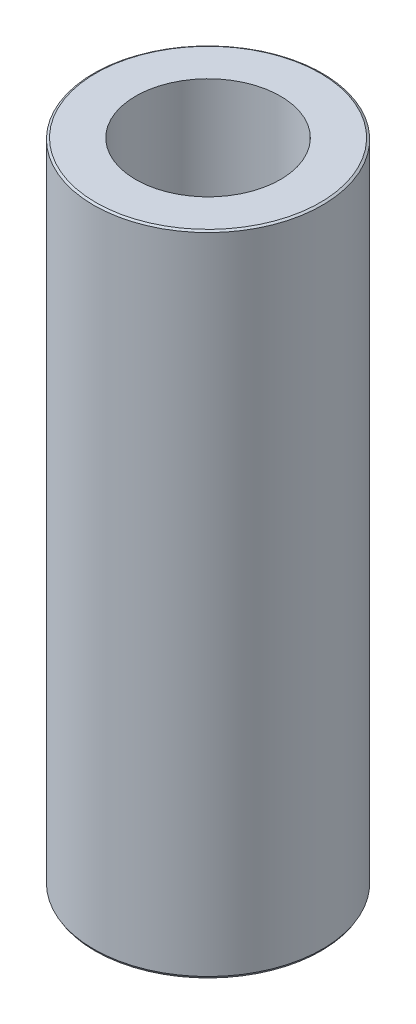
ISO-10303-21;
HEADER;
FILE_DESCRIPTION(('STEP AP214'),'2;1');
FILE_NAME('part.step','',(''),(''),'','','');
FILE_SCHEMA(('AUTOMOTIVE_DESIGN { 1 0 10303 214 1 1 1 1 }'));
ENDSEC;
DATA;
#1=APPLICATION_CONTEXT('core data for automotive mechanical design processes');
#2=APPLICATION_PROTOCOL_DEFINITION('international standard','automotive_design',2000,#1);
#3=PRODUCT_CONTEXT('',#1,'mechanical');
#4=PRODUCT('Part','Part','',(#3));
#5=PRODUCT_RELATED_PRODUCT_CATEGORY('part','',(#4));
#6=PRODUCT_DEFINITION_FORMATION('','',#4);
#7=PRODUCT_DEFINITION_CONTEXT('part definition',#1,'design');
#8=PRODUCT_DEFINITION('design','',#6,#7);
#9=PRODUCT_DEFINITION_SHAPE('','',#8);
#10=(LENGTH_UNIT() NAMED_UNIT(*) SI_UNIT(.MILLI.,.METRE.));
#11=(NAMED_UNIT(*) PLANE_ANGLE_UNIT() SI_UNIT($,.RADIAN.));
#12=(NAMED_UNIT(*) SI_UNIT($,.STERADIAN.) SOLID_ANGLE_UNIT());
#13=UNCERTAINTY_MEASURE_WITH_UNIT(LENGTH_MEASURE(1.E-05),#10,'distance_accuracy_value','');
#14=(GEOMETRIC_REPRESENTATION_CONTEXT(3) GLOBAL_UNCERTAINTY_ASSIGNED_CONTEXT((#13)) GLOBAL_UNIT_ASSIGNED_CONTEXT((#10,
#11,#12)) REPRESENTATION_CONTEXT('',''));
#15=CARTESIAN_POINT('',(0.,0.,0.));
#16=DIRECTION('',(0.,0.,1.));
#17=DIRECTION('',(1.,0.,0.));
#18=AXIS2_PLACEMENT_3D('',#15,#16,#17);
#19=CARTESIAN_POINT('',(0.,254.982256506469,0.));
#20=DIRECTION('',(0.,-1.,0.));
#21=DIRECTION('',(0.,0.,-1.));
#22=AXIS2_PLACEMENT_3D('',#19,#20,#21);
#23=CYLINDRICAL_SURFACE('',#22,45.);
#24=CARTESIAN_POINT('',(0.,254.489808662512,0.));
#25=DIRECTION('',(0.,1.,0.));
#26=DIRECTION('',(0.,0.,1.));
#27=AXIS2_PLACEMENT_3D('',#24,#25,#26);
#28=CIRCLE('',#27,45.);
#29=CARTESIAN_POINT('',(0.,254.489808662512,45.));
#30=VERTEX_POINT('',#29);
#31=EDGE_CURVE('E50',#30,#30,#28,.F.);
#32=ORIENTED_EDGE('',*,*,#31,.T.);
#33=EDGE_LOOP('',(#32));
#34=FACE_BOUND('',#33,.T.);
#35=CARTESIAN_POINT('',(0.,0.851205837235247,0.));
#36=DIRECTION('',(0.,1.,0.));
#37=DIRECTION('',(0.,0.,1.));
#38=AXIS2_PLACEMENT_3D('',#35,#36,#37);
#39=CIRCLE('',#38,45.);
#40=CARTESIAN_POINT('',(0.,0.851205837235247,45.));
#41=VERTEX_POINT('',#40);
#42=EDGE_CURVE('E51',#41,#41,#39,.T.);
#43=ORIENTED_EDGE('',*,*,#42,.T.);
#44=EDGE_LOOP('',(#43));
#45=FACE_BOUND('',#44,.T.);
#46=ADVANCED_FACE('F39',(#34,#45),#23,.T.);
#47=CARTESIAN_POINT('',(0.,254.982256506469,0.));
#48=DIRECTION('',(0.,1.,0.));
#49=DIRECTION('',(0.,0.,1.));
#50=AXIS2_PLACEMENT_3D('',#47,#48,#49);
#51=PLANE('',#50);
#52=CARTESIAN_POINT('',(0.,254.982256506469,0.));
#53=DIRECTION('',(0.,1.,0.));
#54=DIRECTION('',(0.,0.,1.));
#55=AXIS2_PLACEMENT_3D('',#52,#53,#54);
#56=CIRCLE('',#55,44.1487941627648);
#57=CARTESIAN_POINT('',(0.,254.982256506469,44.1487941627648));
#58=VERTEX_POINT('',#57);
#59=EDGE_CURVE('E54',#58,#58,#56,.T.);
#60=ORIENTED_EDGE('',*,*,#59,.T.);
#61=EDGE_LOOP('',(#60));
#62=FACE_BOUND('',#61,.T.);
#63=CARTESIAN_POINT('',(0.,254.982256506469,0.));
#64=DIRECTION('',(0.,1.,0.));
#65=DIRECTION('',(0.,0.,1.));
#66=AXIS2_PLACEMENT_3D('',#63,#64,#65);
#67=CIRCLE('',#66,28.4906687011774);
#68=CARTESIAN_POINT('',(0.,254.982256506469,28.4906687011774));
#69=VERTEX_POINT('',#68);
#70=EDGE_CURVE('E58',#69,#69,#67,.T.);
#71=ORIENTED_EDGE('',*,*,#70,.F.);
#72=EDGE_LOOP('',(#71));
#73=FACE_BOUND('',#72,.T.);
#74=ADVANCED_FACE('F69',(#62,#73),#51,.T.);
#75=CARTESIAN_POINT('',(0.,0.,0.));
#76=DIRECTION('',(0.,1.,0.));
#77=DIRECTION('',(0.,0.,1.));
#78=AXIS2_PLACEMENT_3D('',#75,#76,#77);
#79=PLANE('',#78);
#80=CARTESIAN_POINT('',(0.,0.,0.));
#81=DIRECTION('',(0.,1.,0.));
#82=DIRECTION('',(0.,0.,1.));
#83=AXIS2_PLACEMENT_3D('',#80,#81,#82);
#84=CIRCLE('',#83,44.5075521560425);
#85=CARTESIAN_POINT('',(0.,0.,44.5075521560425));
#86=VERTEX_POINT('',#85);
#87=EDGE_CURVE('E10',#86,#86,#84,.F.);
#88=ORIENTED_EDGE('',*,*,#87,.T.);
#89=EDGE_LOOP('',(#88));
#90=FACE_BOUND('',#89,.T.);
#91=CARTESIAN_POINT('',(0.,0.,0.));
#92=DIRECTION('',(0.,1.,0.));
#93=DIRECTION('',(0.,0.,1.));
#94=AXIS2_PLACEMENT_3D('',#91,#92,#93);
#95=CIRCLE('',#94,28.4906687011774);
#96=CARTESIAN_POINT('',(0.,0.,28.4906687011774));
#97=VERTEX_POINT('',#96);
#98=EDGE_CURVE('E63',#97,#97,#95,.T.);
#99=ORIENTED_EDGE('',*,*,#98,.T.);
#100=EDGE_LOOP('',(#99));
#101=FACE_BOUND('',#100,.T.);
#102=ADVANCED_FACE('F75',(#90,#101),#79,.F.);
#103=CARTESIAN_POINT('',(0.,254.982256506469,0.));
#104=DIRECTION('',(0.,-1.,0.));
#105=DIRECTION('',(0.,0.,-1.));
#106=AXIS2_PLACEMENT_3D('',#103,#104,#105);
#107=CYLINDRICAL_SURFACE('',#106,28.4906687011774);
#108=ORIENTED_EDGE('',*,*,#70,.T.);
#109=EDGE_LOOP('',(#108));
#110=FACE_BOUND('',#109,.T.);
#111=ORIENTED_EDGE('',*,*,#98,.F.);
#112=EDGE_LOOP('',(#111));
#113=FACE_BOUND('',#112,.T.);
#114=ADVANCED_FACE('F70',(#110,#113),#107,.F.);
#115=CARTESIAN_POINT('',(0.,254.982256506469,0.));
#116=DIRECTION('',(0.,-1.,0.));
#117=DIRECTION('',(0.,0.,-1.));
#118=AXIS2_PLACEMENT_3D('',#115,#116,#117);
#119=CONICAL_SURFACE('',#118,44.1487941627648,1.04631344190328);
#120=ORIENTED_EDGE('',*,*,#31,.F.);
#121=EDGE_LOOP('',(#120));
#122=FACE_BOUND('',#121,.T.);
#123=ORIENTED_EDGE('',*,*,#59,.F.);
#124=EDGE_LOOP('',(#123));
#125=FACE_BOUND('',#124,.T.);
#126=ADVANCED_FACE('F81',(#122,#125),#119,.T.);
#127=CARTESIAN_POINT('',(0.,0.851205837235247,0.));
#128=DIRECTION('',(0.,1.,0.));
#129=DIRECTION('',(0.,0.,1.));
#130=AXIS2_PLACEMENT_3D('',#127,#128,#129);
#131=CONICAL_SURFACE('',#130,45.,0.524482884891593);
#132=ORIENTED_EDGE('',*,*,#87,.F.);
#133=EDGE_LOOP('',(#132));
#134=FACE_BOUND('',#133,.T.);
#135=ORIENTED_EDGE('',*,*,#42,.F.);
#136=EDGE_LOOP('',(#135));
#137=FACE_BOUND('',#136,.T.);
#138=ADVANCED_FACE('F45',(#134,#137),#131,.T.);
#139=CLOSED_SHELL('',(#46,#74,#102,#114,#126,#138));
#140=MANIFOLD_SOLID_BREP('B2',#139);
#141=ADVANCED_BREP_SHAPE_REPRESENTATION('',(#18,#140),#14);
#142=SHAPE_DEFINITION_REPRESENTATION(#9,#141);
ENDSEC;
END-ISO-10303-21;
